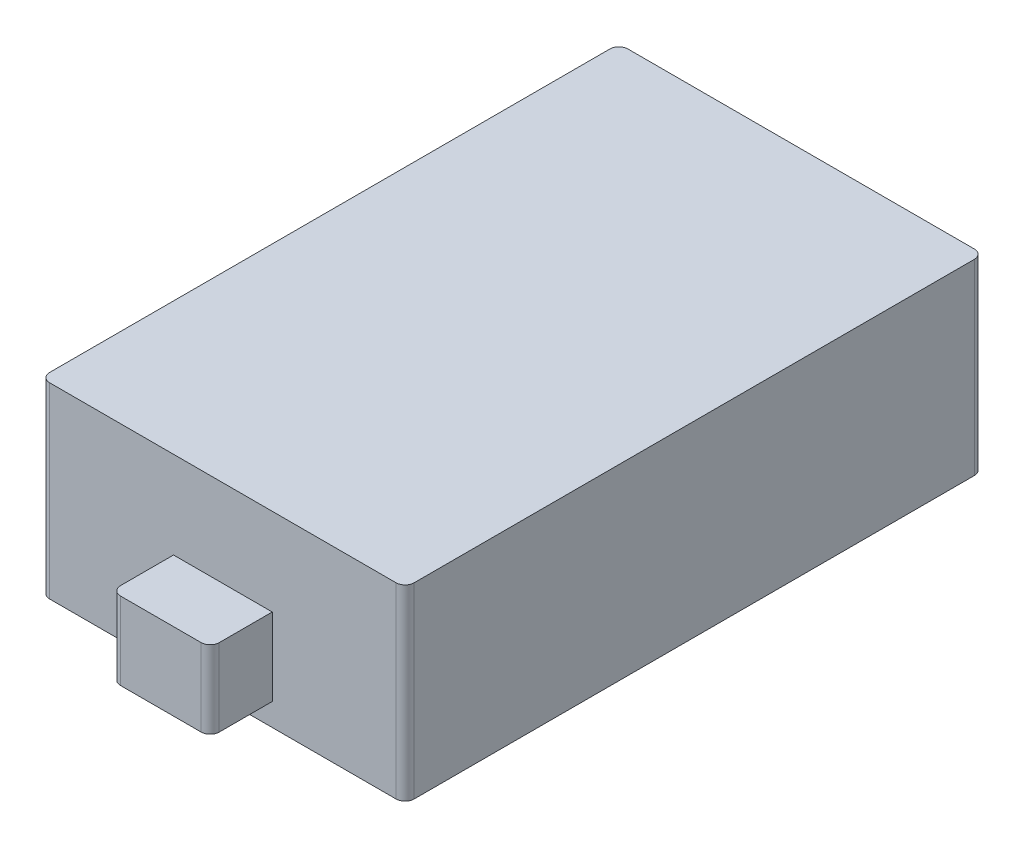
ISO-10303-21;
HEADER;
FILE_DESCRIPTION(('STEP AP214'),'2;1');
FILE_NAME('part.step','',(''),(''),'','','');
FILE_SCHEMA(('AUTOMOTIVE_DESIGN { 1 0 10303 214 1 1 1 1 }'));
ENDSEC;
DATA;
#1=APPLICATION_CONTEXT('core data for automotive mechanical design processes');
#2=APPLICATION_PROTOCOL_DEFINITION('international standard','automotive_design',2000,#1);
#3=PRODUCT_CONTEXT('',#1,'mechanical');
#4=PRODUCT('Part','Part','',(#3));
#5=PRODUCT_RELATED_PRODUCT_CATEGORY('part','',(#4));
#6=PRODUCT_DEFINITION_FORMATION('','',#4);
#7=PRODUCT_DEFINITION_CONTEXT('part definition',#1,'design');
#8=PRODUCT_DEFINITION('design','',#6,#7);
#9=PRODUCT_DEFINITION_SHAPE('','',#8);
#10=(LENGTH_UNIT() NAMED_UNIT(*) SI_UNIT(.MILLI.,.METRE.));
#11=(NAMED_UNIT(*) PLANE_ANGLE_UNIT() SI_UNIT($,.RADIAN.));
#12=(NAMED_UNIT(*) SI_UNIT($,.STERADIAN.) SOLID_ANGLE_UNIT());
#13=UNCERTAINTY_MEASURE_WITH_UNIT(LENGTH_MEASURE(1.E-05),#10,'distance_accuracy_value','');
#14=(GEOMETRIC_REPRESENTATION_CONTEXT(3) GLOBAL_UNCERTAINTY_ASSIGNED_CONTEXT((#13)) GLOBAL_UNIT_ASSIGNED_CONTEXT((#10,
#11,#12)) REPRESENTATION_CONTEXT('',''));
#15=CARTESIAN_POINT('',(0.,0.,0.));
#16=DIRECTION('',(0.,0.,1.));
#17=DIRECTION('',(1.,0.,0.));
#18=AXIS2_PLACEMENT_3D('',#15,#16,#17);
#19=CARTESIAN_POINT('',(16.15,16.6,-25.625));
#20=DIRECTION('',(0.,0.,1.));
#21=DIRECTION('',(1.,0.,0.));
#22=AXIS2_PLACEMENT_3D('',#19,#20,#21);
#23=PLANE('',#22);
#24=DIRECTION('',(-1.,0.,0.));
#25=VECTOR('',#24,1.);
#26=CARTESIAN_POINT('',(16.15,16.6,-25.625));
#27=LINE('',#26,#25);
#28=CARTESIAN_POINT('',(15.35,16.6,-25.625));
#29=VERTEX_POINT('',#28);
#30=CARTESIAN_POINT('',(-15.35,16.6,-25.625));
#31=VERTEX_POINT('',#30);
#32=EDGE_CURVE('E273',#29,#31,#27,.T.);
#33=ORIENTED_EDGE('',*,*,#32,.F.);
#34=DIRECTION('',(0.,-1.,0.));
#35=VECTOR('',#34,1.);
#36=CARTESIAN_POINT('',(15.35,16.6,-25.625));
#37=LINE('',#36,#35);
#38=CARTESIAN_POINT('',(15.35,0.,-25.625));
#39=VERTEX_POINT('',#38);
#40=EDGE_CURVE('E365',#29,#39,#37,.T.);
#41=ORIENTED_EDGE('',*,*,#40,.T.);
#42=DIRECTION('',(-1.,0.,0.));
#43=VECTOR('',#42,1.);
#44=CARTESIAN_POINT('',(16.15,0.,-25.625));
#45=LINE('',#44,#43);
#46=CARTESIAN_POINT('',(-15.35,0.,-25.625));
#47=VERTEX_POINT('',#46);
#48=EDGE_CURVE('E265',#39,#47,#45,.T.);
#49=ORIENTED_EDGE('',*,*,#48,.T.);
#50=DIRECTION('',(0.,-1.,0.));
#51=VECTOR('',#50,1.);
#52=CARTESIAN_POINT('',(-15.35,16.6,-25.625));
#53=LINE('',#52,#51);
#54=EDGE_CURVE('E362',#47,#31,#53,.F.);
#55=ORIENTED_EDGE('',*,*,#54,.T.);
#56=EDGE_LOOP('',(#33,#41,#49,#55));
#57=FACE_BOUND('',#56,.T.);
#58=DIRECTION('',(0.,-1.,0.));
#59=VECTOR('',#58,1.);
#60=CARTESIAN_POINT('',(4.37499999999999,2.,-25.625));
#61=LINE('',#60,#59);
#62=CARTESIAN_POINT('',(4.37499999999999,8.92948727840408,-25.625));
#63=VERTEX_POINT('',#62);
#64=CARTESIAN_POINT('',(4.37499999999999,2.,-25.625));
#65=VERTEX_POINT('',#64);
#66=EDGE_CURVE('E183',#63,#65,#61,.T.);
#67=ORIENTED_EDGE('',*,*,#66,.F.);
#68=DIRECTION('',(1.,0.,0.));
#69=VECTOR('',#68,1.);
#70=CARTESIAN_POINT('',(-4.37500000000001,8.92948727840408,-25.625));
#71=LINE('',#70,#69);
#72=CARTESIAN_POINT('',(-4.37500000000001,8.92948727840408,-25.625));
#73=VERTEX_POINT('',#72);
#74=EDGE_CURVE('E196',#73,#63,#71,.T.);
#75=ORIENTED_EDGE('',*,*,#74,.F.);
#76=DIRECTION('',(0.,1.,0.));
#77=VECTOR('',#76,1.);
#78=CARTESIAN_POINT('',(-4.37500000000001,2.,-25.625));
#79=LINE('',#78,#77);
#80=CARTESIAN_POINT('',(-4.37500000000001,2.,-25.625));
#81=VERTEX_POINT('',#80);
#82=EDGE_CURVE('E206',#81,#73,#79,.T.);
#83=ORIENTED_EDGE('',*,*,#82,.F.);
#84=DIRECTION('',(-1.,0.,0.));
#85=VECTOR('',#84,1.);
#86=CARTESIAN_POINT('',(-4.37500000000001,2.,-25.625));
#87=LINE('',#86,#85);
#88=EDGE_CURVE('E199',#65,#81,#87,.T.);
#89=ORIENTED_EDGE('',*,*,#88,.F.);
#90=EDGE_LOOP('',(#67,#75,#83,#89));
#91=FACE_BOUND('',#90,.T.);
#92=ADVANCED_FACE('F42',(#57,#91),#23,.F.);
#93=CARTESIAN_POINT('',(16.15,16.6,25.625));
#94=DIRECTION('',(0.,0.,-1.));
#95=DIRECTION('',(-1.,0.,0.));
#96=AXIS2_PLACEMENT_3D('',#93,#94,#95);
#97=PLANE('',#96);
#98=DIRECTION('',(1.,0.,0.));
#99=VECTOR('',#98,1.);
#100=CARTESIAN_POINT('',(16.15,0.,25.625));
#101=LINE('',#100,#99);
#102=CARTESIAN_POINT('',(-15.35,0.,25.625));
#103=VERTEX_POINT('',#102);
#104=CARTESIAN_POINT('',(15.35,0.,25.625));
#105=VERTEX_POINT('',#104);
#106=EDGE_CURVE('E281',#103,#105,#101,.T.);
#107=ORIENTED_EDGE('',*,*,#106,.T.);
#108=DIRECTION('',(0.,-1.,0.));
#109=VECTOR('',#108,1.);
#110=CARTESIAN_POINT('',(15.35,16.6,25.625));
#111=LINE('',#110,#109);
#112=CARTESIAN_POINT('',(15.35,16.6,25.625));
#113=VERTEX_POINT('',#112);
#114=EDGE_CURVE('E340',#105,#113,#111,.F.);
#115=ORIENTED_EDGE('',*,*,#114,.T.);
#116=DIRECTION('',(1.,0.,0.));
#117=VECTOR('',#116,1.);
#118=CARTESIAN_POINT('',(16.15,16.6,25.625));
#119=LINE('',#118,#117);
#120=CARTESIAN_POINT('',(-15.35,16.6,25.625));
#121=VERTEX_POINT('',#120);
#122=EDGE_CURVE('E264',#121,#113,#119,.T.);
#123=ORIENTED_EDGE('',*,*,#122,.F.);
#124=DIRECTION('',(0.,-1.,0.));
#125=VECTOR('',#124,1.);
#126=CARTESIAN_POINT('',(-15.35,16.6,25.625));
#127=LINE('',#126,#125);
#128=EDGE_CURVE('E336',#121,#103,#127,.T.);
#129=ORIENTED_EDGE('',*,*,#128,.T.);
#130=EDGE_LOOP('',(#107,#115,#123,#129));
#131=FACE_BOUND('',#130,.T.);
#132=DIRECTION('',(0.,-1.,0.));
#133=VECTOR('',#132,1.);
#134=CARTESIAN_POINT('',(-4.375,2.,25.625));
#135=LINE('',#134,#133);
#136=CARTESIAN_POINT('',(-4.375,8.87,25.625));
#137=VERTEX_POINT('',#136);
#138=CARTESIAN_POINT('',(-4.375,2.,25.625));
#139=VERTEX_POINT('',#138);
#140=EDGE_CURVE('E223',#137,#139,#135,.T.);
#141=ORIENTED_EDGE('',*,*,#140,.F.);
#142=DIRECTION('',(-1.,0.,0.));
#143=VECTOR('',#142,1.);
#144=CARTESIAN_POINT('',(4.375,8.87,25.625));
#145=LINE('',#144,#143);
#146=CARTESIAN_POINT('',(4.375,8.87,25.625));
#147=VERTEX_POINT('',#146);
#148=EDGE_CURVE('E229',#147,#137,#145,.T.);
#149=ORIENTED_EDGE('',*,*,#148,.F.);
#150=DIRECTION('',(0.,1.,0.));
#151=VECTOR('',#150,1.);
#152=CARTESIAN_POINT('',(4.375,2.,25.625));
#153=LINE('',#152,#151);
#154=CARTESIAN_POINT('',(4.375,2.,25.625));
#155=VERTEX_POINT('',#154);
#156=EDGE_CURVE('E241',#155,#147,#153,.T.);
#157=ORIENTED_EDGE('',*,*,#156,.F.);
#158=DIRECTION('',(1.,0.,0.));
#159=VECTOR('',#158,1.);
#160=CARTESIAN_POINT('',(4.375,2.,25.625));
#161=LINE('',#160,#159);
#162=EDGE_CURVE('E237',#139,#155,#161,.T.);
#163=ORIENTED_EDGE('',*,*,#162,.F.);
#164=EDGE_LOOP('',(#141,#149,#157,#163));
#165=FACE_BOUND('',#164,.T.);
#166=ADVANCED_FACE('F407',(#131,#165),#97,.F.);
#167=CARTESIAN_POINT('',(-16.15,16.6,25.625));
#168=DIRECTION('',(1.,0.,0.));
#169=DIRECTION('',(0.,0.,-1.));
#170=AXIS2_PLACEMENT_3D('',#167,#168,#169);
#171=PLANE('',#170);
#172=DIRECTION('',(0.,0.,1.));
#173=VECTOR('',#172,1.);
#174=CARTESIAN_POINT('',(-16.15,0.,25.625));
#175=LINE('',#174,#173);
#176=CARTESIAN_POINT('',(-16.15,0.,-24.825));
#177=VERTEX_POINT('',#176);
#178=CARTESIAN_POINT('',(-16.15,0.,24.825));
#179=VERTEX_POINT('',#178);
#180=EDGE_CURVE('E259',#177,#179,#175,.T.);
#181=ORIENTED_EDGE('',*,*,#180,.T.);
#182=DIRECTION('',(0.,-1.,0.));
#183=VECTOR('',#182,1.);
#184=CARTESIAN_POINT('',(-16.15,16.6,24.825));
#185=LINE('',#184,#183);
#186=CARTESIAN_POINT('',(-16.15,16.6,24.825));
#187=VERTEX_POINT('',#186);
#188=EDGE_CURVE('E359',#179,#187,#185,.F.);
#189=ORIENTED_EDGE('',*,*,#188,.T.);
#190=DIRECTION('',(0.,0.,1.));
#191=VECTOR('',#190,1.);
#192=CARTESIAN_POINT('',(-16.15,16.6,25.625));
#193=LINE('',#192,#191);
#194=CARTESIAN_POINT('',(-16.15,16.6,-24.825));
#195=VERTEX_POINT('',#194);
#196=EDGE_CURVE('E260',#195,#187,#193,.T.);
#197=ORIENTED_EDGE('',*,*,#196,.F.);
#198=DIRECTION('',(0.,-1.,0.));
#199=VECTOR('',#198,1.);
#200=CARTESIAN_POINT('',(-16.15,16.6,-24.825));
#201=LINE('',#200,#199);
#202=EDGE_CURVE('E355',#195,#177,#201,.T.);
#203=ORIENTED_EDGE('',*,*,#202,.T.);
#204=EDGE_LOOP('',(#181,#189,#197,#203));
#205=FACE_BOUND('',#204,.T.);
#206=ADVANCED_FACE('F413',(#205),#171,.F.);
#207=CARTESIAN_POINT('',(16.15,16.6,25.625));
#208=DIRECTION('',(-1.,0.,0.));
#209=DIRECTION('',(0.,0.,1.));
#210=AXIS2_PLACEMENT_3D('',#207,#208,#209);
#211=PLANE('',#210);
#212=DIRECTION('',(0.,0.,-1.));
#213=VECTOR('',#212,1.);
#214=CARTESIAN_POINT('',(16.15,16.6,25.625));
#215=LINE('',#214,#213);
#216=CARTESIAN_POINT('',(16.15,16.6,24.825));
#217=VERTEX_POINT('',#216);
#218=CARTESIAN_POINT('',(16.15,16.6,-24.825));
#219=VERTEX_POINT('',#218);
#220=EDGE_CURVE('E269',#217,#219,#215,.T.);
#221=ORIENTED_EDGE('',*,*,#220,.F.);
#222=DIRECTION('',(0.,-1.,0.));
#223=VECTOR('',#222,1.);
#224=CARTESIAN_POINT('',(16.15,16.6,24.825));
#225=LINE('',#224,#223);
#226=CARTESIAN_POINT('',(16.15,0.,24.825));
#227=VERTEX_POINT('',#226);
#228=EDGE_CURVE('E320',#217,#227,#225,.T.);
#229=ORIENTED_EDGE('',*,*,#228,.T.);
#230=DIRECTION('',(0.,0.,-1.));
#231=VECTOR('',#230,1.);
#232=CARTESIAN_POINT('',(16.15,0.,25.625));
#233=LINE('',#232,#231);
#234=CARTESIAN_POINT('',(16.15,0.,-24.825));
#235=VERTEX_POINT('',#234);
#236=EDGE_CURVE('E285',#227,#235,#233,.T.);
#237=ORIENTED_EDGE('',*,*,#236,.T.);
#238=DIRECTION('',(0.,-1.,0.));
#239=VECTOR('',#238,1.);
#240=CARTESIAN_POINT('',(16.15,16.6,-24.825));
#241=LINE('',#240,#239);
#242=EDGE_CURVE('E317',#235,#219,#241,.F.);
#243=ORIENTED_EDGE('',*,*,#242,.T.);
#244=EDGE_LOOP('',(#221,#229,#237,#243));
#245=FACE_BOUND('',#244,.T.);
#246=ADVANCED_FACE('F421',(#245),#211,.F.);
#247=CARTESIAN_POINT('',(0.,16.6,0.));
#248=DIRECTION('',(0.,1.,0.));
#249=DIRECTION('',(0.,0.,1.));
#250=AXIS2_PLACEMENT_3D('',#247,#248,#249);
#251=PLANE('',#250);
#252=ORIENTED_EDGE('',*,*,#122,.T.);
#253=CARTESIAN_POINT('',(15.35,16.6,24.825));
#254=DIRECTION('',(0.,1.,0.));
#255=DIRECTION('',(0.,0.,1.));
#256=AXIS2_PLACEMENT_3D('',#253,#254,#255);
#257=CIRCLE('',#256,0.8);
#258=EDGE_CURVE('E352',#113,#217,#257,.T.);
#259=ORIENTED_EDGE('',*,*,#258,.T.);
#260=ORIENTED_EDGE('',*,*,#220,.T.);
#261=CARTESIAN_POINT('',(15.35,16.6,-24.825));
#262=DIRECTION('',(0.,1.,0.));
#263=DIRECTION('',(0.,0.,1.));
#264=AXIS2_PLACEMENT_3D('',#261,#262,#263);
#265=CIRCLE('',#264,0.8);
#266=EDGE_CURVE('E346',#219,#29,#265,.T.);
#267=ORIENTED_EDGE('',*,*,#266,.T.);
#268=ORIENTED_EDGE('',*,*,#32,.T.);
#269=CARTESIAN_POINT('',(-15.35,16.6,-24.825));
#270=DIRECTION('',(0.,1.,0.));
#271=DIRECTION('',(0.,0.,1.));
#272=AXIS2_PLACEMENT_3D('',#269,#270,#271);
#273=CIRCLE('',#272,0.8);
#274=EDGE_CURVE('E343',#31,#195,#273,.T.);
#275=ORIENTED_EDGE('',*,*,#274,.T.);
#276=ORIENTED_EDGE('',*,*,#196,.T.);
#277=CARTESIAN_POINT('',(-15.35,16.6,24.825));
#278=DIRECTION('',(0.,1.,0.));
#279=DIRECTION('',(0.,0.,1.));
#280=AXIS2_PLACEMENT_3D('',#277,#278,#279);
#281=CIRCLE('',#280,0.8);
#282=EDGE_CURVE('E349',#187,#121,#281,.T.);
#283=ORIENTED_EDGE('',*,*,#282,.T.);
#284=EDGE_LOOP('',(#252,#259,#260,#267,#268,#275,#276,#283));
#285=FACE_BOUND('',#284,.T.);
#286=ADVANCED_FACE('F423',(#285),#251,.T.);
#287=CARTESIAN_POINT('',(0.,0.,0.));
#288=DIRECTION('',(0.,1.,0.));
#289=DIRECTION('',(0.,0.,1.));
#290=AXIS2_PLACEMENT_3D('',#287,#288,#289);
#291=PLANE('',#290);
#292=ORIENTED_EDGE('',*,*,#236,.F.);
#293=CARTESIAN_POINT('',(15.35,0.,24.825));
#294=DIRECTION('',(0.,1.,0.));
#295=DIRECTION('',(0.,0.,1.));
#296=AXIS2_PLACEMENT_3D('',#293,#294,#295);
#297=CIRCLE('',#296,0.8);
#298=EDGE_CURVE('E333',#227,#105,#297,.F.);
#299=ORIENTED_EDGE('',*,*,#298,.T.);
#300=ORIENTED_EDGE('',*,*,#106,.F.);
#301=CARTESIAN_POINT('',(-15.35,0.,24.825));
#302=DIRECTION('',(0.,1.,0.));
#303=DIRECTION('',(0.,0.,1.));
#304=AXIS2_PLACEMENT_3D('',#301,#302,#303);
#305=CIRCLE('',#304,0.8);
#306=EDGE_CURVE('E330',#103,#179,#305,.F.);
#307=ORIENTED_EDGE('',*,*,#306,.T.);
#308=ORIENTED_EDGE('',*,*,#180,.F.);
#309=CARTESIAN_POINT('',(-15.35,0.,-24.825));
#310=DIRECTION('',(0.,1.,0.));
#311=DIRECTION('',(0.,0.,1.));
#312=AXIS2_PLACEMENT_3D('',#309,#310,#311);
#313=CIRCLE('',#312,0.8);
#314=EDGE_CURVE('E324',#177,#47,#313,.F.);
#315=ORIENTED_EDGE('',*,*,#314,.T.);
#316=ORIENTED_EDGE('',*,*,#48,.F.);
#317=CARTESIAN_POINT('',(15.35,0.,-24.825));
#318=DIRECTION('',(0.,1.,0.));
#319=DIRECTION('',(0.,0.,1.));
#320=AXIS2_PLACEMENT_3D('',#317,#318,#319);
#321=CIRCLE('',#320,0.8);
#322=EDGE_CURVE('E327',#39,#235,#321,.F.);
#323=ORIENTED_EDGE('',*,*,#322,.T.);
#324=EDGE_LOOP('',(#292,#299,#300,#307,#308,#315,#316,#323));
#325=FACE_BOUND('',#324,.T.);
#326=ADVANCED_FACE('F419',(#325),#291,.F.);
#327=CARTESIAN_POINT('',(-4.375,2.,31.125));
#328=DIRECTION('',(1.,0.,0.));
#329=DIRECTION('',(0.,0.,-1.));
#330=AXIS2_PLACEMENT_3D('',#327,#328,#329);
#331=PLANE('',#330);
#332=DIRECTION('',(0.,0.,-1.));
#333=VECTOR('',#332,1.);
#334=CARTESIAN_POINT('',(-4.375,2.,31.125));
#335=LINE('',#334,#333);
#336=CARTESIAN_POINT('',(-4.375,2.,30.325));
#337=VERTEX_POINT('',#336);
#338=EDGE_CURVE('E256',#337,#139,#335,.T.);
#339=ORIENTED_EDGE('',*,*,#338,.F.);
#340=DIRECTION('',(0.,-1.,0.));
#341=VECTOR('',#340,1.);
#342=CARTESIAN_POINT('',(-4.375,8.87,30.325));
#343=LINE('',#342,#341);
#344=CARTESIAN_POINT('',(-4.375,8.87,30.325));
#345=VERTEX_POINT('',#344);
#346=EDGE_CURVE('E305',#337,#345,#343,.F.);
#347=ORIENTED_EDGE('',*,*,#346,.T.);
#348=DIRECTION('',(0.,0.,-1.));
#349=VECTOR('',#348,1.);
#350=CARTESIAN_POINT('',(-4.375,8.87,31.125));
#351=LINE('',#350,#349);
#352=EDGE_CURVE('E233',#345,#137,#351,.T.);
#353=ORIENTED_EDGE('',*,*,#352,.T.);
#354=ORIENTED_EDGE('',*,*,#140,.T.);
#355=EDGE_LOOP('',(#339,#347,#353,#354));
#356=FACE_BOUND('',#355,.T.);
#357=ADVANCED_FACE('F476',(#356),#331,.F.);
#358=CARTESIAN_POINT('',(4.375,2.,31.125));
#359=DIRECTION('',(0.,1.,0.));
#360=DIRECTION('',(-1.,0.,0.));
#361=AXIS2_PLACEMENT_3D('',#358,#359,#360);
#362=PLANE('',#361);
#363=DIRECTION('',(1.,0.,0.));
#364=VECTOR('',#363,1.);
#365=CARTESIAN_POINT('',(4.375,2.,31.125));
#366=LINE('',#365,#364);
#367=CARTESIAN_POINT('',(-3.57500000000001,2.,31.125));
#368=VERTEX_POINT('',#367);
#369=CARTESIAN_POINT('',(3.575,2.,31.125));
#370=VERTEX_POINT('',#369);
#371=EDGE_CURVE('E224',#368,#370,#366,.T.);
#372=ORIENTED_EDGE('',*,*,#371,.F.);
#373=CARTESIAN_POINT('',(-3.575,2.,30.325));
#374=DIRECTION('',(0.,1.,0.));
#375=DIRECTION('',(-1.,0.,0.));
#376=AXIS2_PLACEMENT_3D('',#373,#374,#375);
#377=CIRCLE('',#376,0.8);
#378=EDGE_CURVE('E302',#368,#337,#377,.F.);
#379=ORIENTED_EDGE('',*,*,#378,.T.);
#380=ORIENTED_EDGE('',*,*,#338,.T.);
#381=ORIENTED_EDGE('',*,*,#162,.T.);
#382=DIRECTION('',(0.,0.,-1.));
#383=VECTOR('',#382,1.);
#384=CARTESIAN_POINT('',(4.375,2.,31.125));
#385=LINE('',#384,#383);
#386=CARTESIAN_POINT('',(4.375,2.,30.325));
#387=VERTEX_POINT('',#386);
#388=EDGE_CURVE('E253',#387,#155,#385,.T.);
#389=ORIENTED_EDGE('',*,*,#388,.F.);
#390=CARTESIAN_POINT('',(3.575,2.,30.325));
#391=DIRECTION('',(0.,1.,0.));
#392=DIRECTION('',(-1.,0.,0.));
#393=AXIS2_PLACEMENT_3D('',#390,#391,#392);
#394=CIRCLE('',#393,0.8);
#395=EDGE_CURVE('E299',#387,#370,#394,.F.);
#396=ORIENTED_EDGE('',*,*,#395,.T.);
#397=EDGE_LOOP('',(#372,#379,#380,#381,#389,#396));
#398=FACE_BOUND('',#397,.T.);
#399=ADVANCED_FACE('F481',(#398),#362,.F.);
#400=CARTESIAN_POINT('',(4.375,2.,31.125));
#401=DIRECTION('',(-1.,0.,0.));
#402=DIRECTION('',(0.,-1.,0.));
#403=AXIS2_PLACEMENT_3D('',#400,#401,#402);
#404=PLANE('',#403);
#405=DIRECTION('',(0.,0.,-1.));
#406=VECTOR('',#405,1.);
#407=CARTESIAN_POINT('',(4.375,8.87,31.125));
#408=LINE('',#407,#406);
#409=CARTESIAN_POINT('',(4.375,8.87,30.325));
#410=VERTEX_POINT('',#409);
#411=EDGE_CURVE('E250',#410,#147,#408,.T.);
#412=ORIENTED_EDGE('',*,*,#411,.F.);
#413=DIRECTION('',(0.,1.,0.));
#414=VECTOR('',#413,1.);
#415=CARTESIAN_POINT('',(4.375,2.,30.325));
#416=LINE('',#415,#414);
#417=EDGE_CURVE('E314',#410,#387,#416,.F.);
#418=ORIENTED_EDGE('',*,*,#417,.T.);
#419=ORIENTED_EDGE('',*,*,#388,.T.);
#420=ORIENTED_EDGE('',*,*,#156,.T.);
#421=EDGE_LOOP('',(#412,#418,#419,#420));
#422=FACE_BOUND('',#421,.T.);
#423=ADVANCED_FACE('F489',(#422),#404,.F.);
#424=CARTESIAN_POINT('',(4.375,8.87,31.125));
#425=DIRECTION('',(0.,-1.,0.));
#426=DIRECTION('',(0.,0.,-1.));
#427=AXIS2_PLACEMENT_3D('',#424,#425,#426);
#428=PLANE('',#427);
#429=ORIENTED_EDGE('',*,*,#352,.F.);
#430=CARTESIAN_POINT('',(-3.575,8.87,30.325));
#431=DIRECTION('',(0.,-1.,0.));
#432=DIRECTION('',(0.,0.,-1.));
#433=AXIS2_PLACEMENT_3D('',#430,#431,#432);
#434=CIRCLE('',#433,0.8);
#435=CARTESIAN_POINT('',(-3.575,8.87,31.125));
#436=VERTEX_POINT('',#435);
#437=EDGE_CURVE('E311',#345,#436,#434,.F.);
#438=ORIENTED_EDGE('',*,*,#437,.T.);
#439=DIRECTION('',(-1.,0.,0.));
#440=VECTOR('',#439,1.);
#441=CARTESIAN_POINT('',(4.375,8.87,31.125));
#442=LINE('',#441,#440);
#443=CARTESIAN_POINT('',(3.575,8.87,31.125));
#444=VERTEX_POINT('',#443);
#445=EDGE_CURVE('E228',#444,#436,#442,.T.);
#446=ORIENTED_EDGE('',*,*,#445,.F.);
#447=CARTESIAN_POINT('',(3.575,8.87,30.325));
#448=DIRECTION('',(0.,-1.,0.));
#449=DIRECTION('',(0.,0.,-1.));
#450=AXIS2_PLACEMENT_3D('',#447,#448,#449);
#451=CIRCLE('',#450,0.8);
#452=EDGE_CURVE('E308',#444,#410,#451,.F.);
#453=ORIENTED_EDGE('',*,*,#452,.T.);
#454=ORIENTED_EDGE('',*,*,#411,.T.);
#455=ORIENTED_EDGE('',*,*,#148,.T.);
#456=EDGE_LOOP('',(#429,#438,#446,#453,#454,#455));
#457=FACE_BOUND('',#456,.T.);
#458=ADVANCED_FACE('F493',(#457),#428,.F.);
#459=CARTESIAN_POINT('',(0.,0.,31.125));
#460=DIRECTION('',(0.,0.,1.));
#461=DIRECTION('',(1.,0.,0.));
#462=AXIS2_PLACEMENT_3D('',#459,#460,#461);
#463=PLANE('',#462);
#464=ORIENTED_EDGE('',*,*,#445,.T.);
#465=DIRECTION('',(0.,-1.,0.));
#466=VECTOR('',#465,1.);
#467=CARTESIAN_POINT('',(-3.575,2.,31.125));
#468=LINE('',#467,#466);
#469=EDGE_CURVE('E295',#436,#368,#468,.T.);
#470=ORIENTED_EDGE('',*,*,#469,.T.);
#471=ORIENTED_EDGE('',*,*,#371,.T.);
#472=DIRECTION('',(0.,1.,0.));
#473=VECTOR('',#472,1.);
#474=CARTESIAN_POINT('',(3.575,8.87,31.125));
#475=LINE('',#474,#473);
#476=EDGE_CURVE('E277',#370,#444,#475,.T.);
#477=ORIENTED_EDGE('',*,*,#476,.T.);
#478=EDGE_LOOP('',(#464,#470,#471,#477));
#479=FACE_BOUND('',#478,.T.);
#480=ADVANCED_FACE('F497',(#479),#463,.T.);
#481=CARTESIAN_POINT('',(4.37499999999999,2.,-31.125));
#482=DIRECTION('',(-1.,0.,0.));
#483=DIRECTION('',(0.,0.,1.));
#484=AXIS2_PLACEMENT_3D('',#481,#482,#483);
#485=PLANE('',#484);
#486=DIRECTION('',(0.,0.,1.));
#487=VECTOR('',#486,1.);
#488=CARTESIAN_POINT('',(4.37499999999999,2.,-31.125));
#489=LINE('',#488,#487);
#490=CARTESIAN_POINT('',(4.37499999999999,2.,-30.325));
#491=VERTEX_POINT('',#490);
#492=EDGE_CURVE('E220',#491,#65,#489,.T.);
#493=ORIENTED_EDGE('',*,*,#492,.F.);
#494=DIRECTION('',(0.,-1.,0.));
#495=VECTOR('',#494,1.);
#496=CARTESIAN_POINT('',(4.37499999999999,8.92948727840408,-30.325));
#497=LINE('',#496,#495);
#498=CARTESIAN_POINT('',(4.37499999999999,8.92948727840408,-30.325));
#499=VERTEX_POINT('',#498);
#500=EDGE_CURVE('E11',#491,#499,#497,.F.);
#501=ORIENTED_EDGE('',*,*,#500,.T.);
#502=DIRECTION('',(0.,0.,1.));
#503=VECTOR('',#502,1.);
#504=CARTESIAN_POINT('',(4.37499999999999,8.92948727840408,-31.125));
#505=LINE('',#504,#503);
#506=EDGE_CURVE('E180',#499,#63,#505,.T.);
#507=ORIENTED_EDGE('',*,*,#506,.T.);
#508=ORIENTED_EDGE('',*,*,#66,.T.);
#509=EDGE_LOOP('',(#493,#501,#507,#508));
#510=FACE_BOUND('',#509,.T.);
#511=ADVANCED_FACE('F182',(#510),#485,.F.);
#512=CARTESIAN_POINT('',(-4.37500000000001,2.,-31.125));
#513=DIRECTION('',(0.,1.,0.));
#514=DIRECTION('',(-1.,0.,0.));
#515=AXIS2_PLACEMENT_3D('',#512,#513,#514);
#516=PLANE('',#515);
#517=DIRECTION('',(0.,0.,1.));
#518=VECTOR('',#517,1.);
#519=CARTESIAN_POINT('',(-4.37500000000001,2.,-31.125));
#520=LINE('',#519,#518);
#521=CARTESIAN_POINT('',(-4.37500000000001,2.,-30.325));
#522=VERTEX_POINT('',#521);
#523=EDGE_CURVE('E217',#522,#81,#520,.T.);
#524=ORIENTED_EDGE('',*,*,#523,.F.);
#525=CARTESIAN_POINT('',(-3.57500000000001,2.,-30.325));
#526=DIRECTION('',(0.,1.,0.));
#527=DIRECTION('',(-1.,0.,0.));
#528=AXIS2_PLACEMENT_3D('',#525,#526,#527);
#529=CIRCLE('',#528,0.8);
#530=CARTESIAN_POINT('',(-3.57500000000001,2.,-31.125));
#531=VERTEX_POINT('',#530);
#532=EDGE_CURVE('E51',#522,#531,#529,.F.);
#533=ORIENTED_EDGE('',*,*,#532,.T.);
#534=DIRECTION('',(-1.,0.,0.));
#535=VECTOR('',#534,1.);
#536=CARTESIAN_POINT('',(-4.37500000000001,2.,-31.125));
#537=LINE('',#536,#535);
#538=CARTESIAN_POINT('',(3.57499999999999,2.,-31.125));
#539=VERTEX_POINT('',#538);
#540=EDGE_CURVE('E205',#539,#531,#537,.T.);
#541=ORIENTED_EDGE('',*,*,#540,.F.);
#542=CARTESIAN_POINT('',(3.57499999999999,2.,-30.325));
#543=DIRECTION('',(0.,1.,0.));
#544=DIRECTION('',(-1.,0.,0.));
#545=AXIS2_PLACEMENT_3D('',#542,#543,#544);
#546=CIRCLE('',#545,0.8);
#547=EDGE_CURVE('E58',#539,#491,#546,.F.);
#548=ORIENTED_EDGE('',*,*,#547,.T.);
#549=ORIENTED_EDGE('',*,*,#492,.T.);
#550=ORIENTED_EDGE('',*,*,#88,.T.);
#551=EDGE_LOOP('',(#524,#533,#541,#548,#549,#550));
#552=FACE_BOUND('',#551,.T.);
#553=ADVANCED_FACE('F388',(#552),#516,.F.);
#554=CARTESIAN_POINT('',(-4.37500000000001,2.,-31.125));
#555=DIRECTION('',(1.,0.,0.));
#556=DIRECTION('',(0.,0.,-1.));
#557=AXIS2_PLACEMENT_3D('',#554,#555,#556);
#558=PLANE('',#557);
#559=DIRECTION('',(0.,0.,1.));
#560=VECTOR('',#559,1.);
#561=CARTESIAN_POINT('',(-4.37500000000001,8.92948727840408,-31.125));
#562=LINE('',#561,#560);
#563=CARTESIAN_POINT('',(-4.37500000000001,8.92948727840408,-30.325));
#564=VERTEX_POINT('',#563);
#565=EDGE_CURVE('E189',#564,#73,#562,.T.);
#566=ORIENTED_EDGE('',*,*,#565,.F.);
#567=DIRECTION('',(0.,1.,0.));
#568=VECTOR('',#567,1.);
#569=CARTESIAN_POINT('',(-4.37500000000001,2.,-30.325));
#570=LINE('',#569,#568);
#571=EDGE_CURVE('E66',#564,#522,#570,.F.);
#572=ORIENTED_EDGE('',*,*,#571,.T.);
#573=ORIENTED_EDGE('',*,*,#523,.T.);
#574=ORIENTED_EDGE('',*,*,#82,.T.);
#575=EDGE_LOOP('',(#566,#572,#573,#574));
#576=FACE_BOUND('',#575,.T.);
#577=ADVANCED_FACE('F396',(#576),#558,.F.);
#578=CARTESIAN_POINT('',(-4.37500000000001,8.92948727840408,-31.125));
#579=DIRECTION('',(0.,-1.,0.));
#580=DIRECTION('',(0.,0.,-1.));
#581=AXIS2_PLACEMENT_3D('',#578,#579,#580);
#582=PLANE('',#581);
#583=DIRECTION('',(1.,0.,0.));
#584=VECTOR('',#583,1.);
#585=CARTESIAN_POINT('',(-4.37500000000001,8.92948727840408,-31.125));
#586=LINE('',#585,#584);
#587=CARTESIAN_POINT('',(-3.57500000000001,8.92948727840408,-31.125));
#588=VERTEX_POINT('',#587);
#589=CARTESIAN_POINT('',(3.57499999999999,8.92948727840408,-31.125));
#590=VERTEX_POINT('',#589);
#591=EDGE_CURVE('E190',#588,#590,#586,.T.);
#592=ORIENTED_EDGE('',*,*,#591,.F.);
#593=CARTESIAN_POINT('',(-3.57500000000001,8.92948727840408,-30.325));
#594=DIRECTION('',(0.,-1.,0.));
#595=DIRECTION('',(0.,0.,-1.));
#596=AXIS2_PLACEMENT_3D('',#593,#594,#595);
#597=CIRCLE('',#596,0.8);
#598=EDGE_CURVE('E380',#588,#564,#597,.F.);
#599=ORIENTED_EDGE('',*,*,#598,.T.);
#600=ORIENTED_EDGE('',*,*,#565,.T.);
#601=ORIENTED_EDGE('',*,*,#74,.T.);
#602=ORIENTED_EDGE('',*,*,#506,.F.);
#603=CARTESIAN_POINT('',(3.57499999999999,8.92948727840408,-30.325));
#604=DIRECTION('',(0.,-1.,0.));
#605=DIRECTION('',(0.,0.,-1.));
#606=AXIS2_PLACEMENT_3D('',#603,#604,#605);
#607=CIRCLE('',#606,0.8);
#608=EDGE_CURVE('E377',#499,#590,#607,.F.);
#609=ORIENTED_EDGE('',*,*,#608,.T.);
#610=EDGE_LOOP('',(#592,#599,#600,#601,#602,#609));
#611=FACE_BOUND('',#610,.T.);
#612=ADVANCED_FACE('F203',(#611),#582,.F.);
#613=CARTESIAN_POINT('',(0.,0.,-31.125));
#614=DIRECTION('',(0.,0.,-1.));
#615=DIRECTION('',(-1.,0.,0.));
#616=AXIS2_PLACEMENT_3D('',#613,#614,#615);
#617=PLANE('',#616);
#618=ORIENTED_EDGE('',*,*,#540,.T.);
#619=DIRECTION('',(0.,1.,0.));
#620=VECTOR('',#619,1.);
#621=CARTESIAN_POINT('',(-3.57500000000001,8.92948727840408,-31.125));
#622=LINE('',#621,#620);
#623=EDGE_CURVE('E373',#531,#588,#622,.T.);
#624=ORIENTED_EDGE('',*,*,#623,.T.);
#625=ORIENTED_EDGE('',*,*,#591,.T.);
#626=DIRECTION('',(0.,-1.,0.));
#627=VECTOR('',#626,1.);
#628=CARTESIAN_POINT('',(3.57499999999999,2.,-31.125));
#629=LINE('',#628,#627);
#630=EDGE_CURVE('E369',#590,#539,#629,.T.);
#631=ORIENTED_EDGE('',*,*,#630,.T.);
#632=EDGE_LOOP('',(#618,#624,#625,#631));
#633=FACE_BOUND('',#632,.T.);
#634=ADVANCED_FACE('F392',(#633),#617,.T.);
#635=CARTESIAN_POINT('',(-3.575,0.,30.325));
#636=DIRECTION('',(0.,1.,0.));
#637=DIRECTION('',(0.,0.,1.));
#638=AXIS2_PLACEMENT_3D('',#635,#636,#637);
#639=CYLINDRICAL_SURFACE('',#638,0.8);
#640=ORIENTED_EDGE('',*,*,#437,.F.);
#641=ORIENTED_EDGE('',*,*,#346,.F.);
#642=ORIENTED_EDGE('',*,*,#378,.F.);
#643=ORIENTED_EDGE('',*,*,#469,.F.);
#644=EDGE_LOOP('',(#640,#641,#642,#643));
#645=FACE_BOUND('',#644,.T.);
#646=ADVANCED_FACE('F429',(#645),#639,.T.);
#647=CARTESIAN_POINT('',(3.57499999999999,0.,30.325));
#648=DIRECTION('',(0.,-1.,0.));
#649=DIRECTION('',(1.,0.,0.));
#650=AXIS2_PLACEMENT_3D('',#647,#648,#649);
#651=CYLINDRICAL_SURFACE('',#650,0.8);
#652=ORIENTED_EDGE('',*,*,#395,.F.);
#653=ORIENTED_EDGE('',*,*,#417,.F.);
#654=ORIENTED_EDGE('',*,*,#452,.F.);
#655=ORIENTED_EDGE('',*,*,#476,.F.);
#656=EDGE_LOOP('',(#652,#653,#654,#655));
#657=FACE_BOUND('',#656,.T.);
#658=ADVANCED_FACE('F432',(#657),#651,.T.);
#659=CARTESIAN_POINT('',(15.35,16.6,24.825));
#660=DIRECTION('',(0.,-1.,0.));
#661=DIRECTION('',(0.,0.,-1.));
#662=AXIS2_PLACEMENT_3D('',#659,#660,#661);
#663=CYLINDRICAL_SURFACE('',#662,0.8);
#664=ORIENTED_EDGE('',*,*,#258,.F.);
#665=ORIENTED_EDGE('',*,*,#114,.F.);
#666=ORIENTED_EDGE('',*,*,#298,.F.);
#667=ORIENTED_EDGE('',*,*,#228,.F.);
#668=EDGE_LOOP('',(#664,#665,#666,#667));
#669=FACE_BOUND('',#668,.T.);
#670=ADVANCED_FACE('F436',(#669),#663,.T.);
#671=CARTESIAN_POINT('',(-15.35,16.6,24.825));
#672=DIRECTION('',(0.,-1.,0.));
#673=DIRECTION('',(0.,0.,-1.));
#674=AXIS2_PLACEMENT_3D('',#671,#672,#673);
#675=CYLINDRICAL_SURFACE('',#674,0.8);
#676=ORIENTED_EDGE('',*,*,#282,.F.);
#677=ORIENTED_EDGE('',*,*,#188,.F.);
#678=ORIENTED_EDGE('',*,*,#306,.F.);
#679=ORIENTED_EDGE('',*,*,#128,.F.);
#680=EDGE_LOOP('',(#676,#677,#678,#679));
#681=FACE_BOUND('',#680,.T.);
#682=ADVANCED_FACE('F440',(#681),#675,.T.);
#683=CARTESIAN_POINT('',(15.35,16.6,-24.825));
#684=DIRECTION('',(0.,-1.,0.));
#685=DIRECTION('',(0.,0.,-1.));
#686=AXIS2_PLACEMENT_3D('',#683,#684,#685);
#687=CYLINDRICAL_SURFACE('',#686,0.8);
#688=ORIENTED_EDGE('',*,*,#266,.F.);
#689=ORIENTED_EDGE('',*,*,#242,.F.);
#690=ORIENTED_EDGE('',*,*,#322,.F.);
#691=ORIENTED_EDGE('',*,*,#40,.F.);
#692=EDGE_LOOP('',(#688,#689,#690,#691));
#693=FACE_BOUND('',#692,.T.);
#694=ADVANCED_FACE('F444',(#693),#687,.T.);
#695=CARTESIAN_POINT('',(-15.35,16.6,-24.825));
#696=DIRECTION('',(0.,-1.,0.));
#697=DIRECTION('',(0.,0.,-1.));
#698=AXIS2_PLACEMENT_3D('',#695,#696,#697);
#699=CYLINDRICAL_SURFACE('',#698,0.8);
#700=ORIENTED_EDGE('',*,*,#274,.F.);
#701=ORIENTED_EDGE('',*,*,#54,.F.);
#702=ORIENTED_EDGE('',*,*,#314,.F.);
#703=ORIENTED_EDGE('',*,*,#202,.F.);
#704=EDGE_LOOP('',(#700,#701,#702,#703));
#705=FACE_BOUND('',#704,.T.);
#706=ADVANCED_FACE('F405',(#705),#699,.T.);
#707=CARTESIAN_POINT('',(-3.57500000000001,0.,-30.325));
#708=DIRECTION('',(0.,-1.,0.));
#709=DIRECTION('',(0.,0.,-1.));
#710=AXIS2_PLACEMENT_3D('',#707,#708,#709);
#711=CYLINDRICAL_SURFACE('',#710,0.8);
#712=ORIENTED_EDGE('',*,*,#532,.F.);
#713=ORIENTED_EDGE('',*,*,#571,.F.);
#714=ORIENTED_EDGE('',*,*,#598,.F.);
#715=ORIENTED_EDGE('',*,*,#623,.F.);
#716=EDGE_LOOP('',(#712,#713,#714,#715));
#717=FACE_BOUND('',#716,.T.);
#718=ADVANCED_FACE('F395',(#717),#711,.T.);
#719=CARTESIAN_POINT('',(3.57499999999999,0.,-30.325));
#720=DIRECTION('',(0.,1.,0.));
#721=DIRECTION('',(0.,0.,1.));
#722=AXIS2_PLACEMENT_3D('',#719,#720,#721);
#723=CYLINDRICAL_SURFACE('',#722,0.8);
#724=ORIENTED_EDGE('',*,*,#608,.F.);
#725=ORIENTED_EDGE('',*,*,#500,.F.);
#726=ORIENTED_EDGE('',*,*,#547,.F.);
#727=ORIENTED_EDGE('',*,*,#630,.F.);
#728=EDGE_LOOP('',(#724,#725,#726,#727));
#729=FACE_BOUND('',#728,.T.);
#730=ADVANCED_FACE('F44',(#729),#723,.T.);
#731=CLOSED_SHELL('',(#92,#166,#206,#246,#286,#326,#357,#399,#423,#458,#480,#511,#553,#577,#612,
#634,#646,#658,#670,#682,#694,#706,#718,#730));
#732=MANIFOLD_SOLID_BREP('B2',#731);
#733=ADVANCED_BREP_SHAPE_REPRESENTATION('',(#18,#732),#14);
#734=SHAPE_DEFINITION_REPRESENTATION(#9,#733);
ENDSEC;
END-ISO-10303-21;
